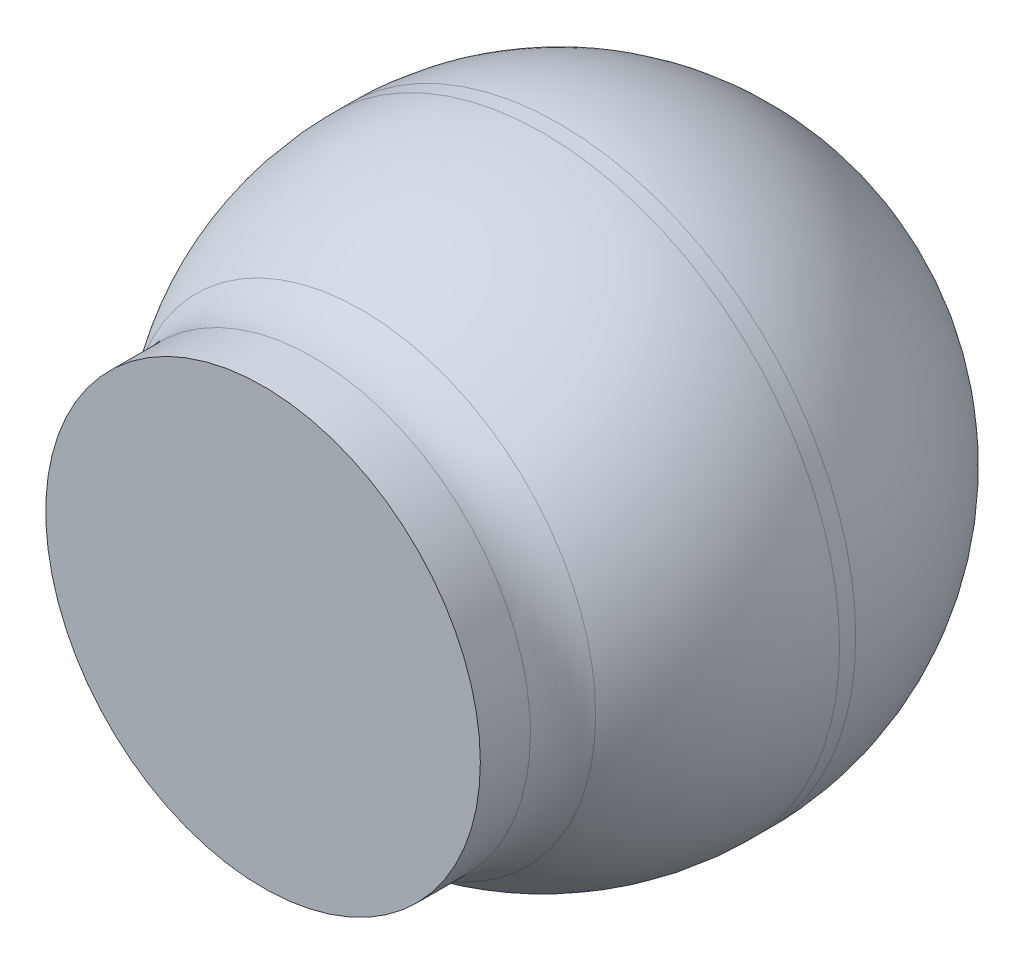
ISO-10303-21;
HEADER;
FILE_DESCRIPTION(('STEP AP214'),'2;1');
FILE_NAME('part.step','',(''),(''),'','','');
FILE_SCHEMA(('AUTOMOTIVE_DESIGN { 1 0 10303 214 1 1 1 1 }'));
ENDSEC;
DATA;
#1=APPLICATION_CONTEXT('core data for automotive mechanical design processes');
#2=APPLICATION_PROTOCOL_DEFINITION('international standard','automotive_design',2000,#1);
#3=PRODUCT_CONTEXT('',#1,'mechanical');
#4=PRODUCT('Part','Part','',(#3));
#5=PRODUCT_RELATED_PRODUCT_CATEGORY('part','',(#4));
#6=PRODUCT_DEFINITION_FORMATION('','',#4);
#7=PRODUCT_DEFINITION_CONTEXT('part definition',#1,'design');
#8=PRODUCT_DEFINITION('design','',#6,#7);
#9=PRODUCT_DEFINITION_SHAPE('','',#8);
#10=(LENGTH_UNIT() NAMED_UNIT(*) SI_UNIT(.MILLI.,.METRE.));
#11=(NAMED_UNIT(*) PLANE_ANGLE_UNIT() SI_UNIT($,.RADIAN.));
#12=(NAMED_UNIT(*) SI_UNIT($,.STERADIAN.) SOLID_ANGLE_UNIT());
#13=UNCERTAINTY_MEASURE_WITH_UNIT(LENGTH_MEASURE(1.E-05),#10,'distance_accuracy_value','');
#14=(GEOMETRIC_REPRESENTATION_CONTEXT(3) GLOBAL_UNCERTAINTY_ASSIGNED_CONTEXT((#13)) GLOBAL_UNIT_ASSIGNED_CONTEXT((#10,
#11,#12)) REPRESENTATION_CONTEXT('',''));
#15=CARTESIAN_POINT('',(0.,0.,0.));
#16=DIRECTION('',(0.,0.,1.));
#17=DIRECTION('',(1.,0.,0.));
#18=AXIS2_PLACEMENT_3D('',#15,#16,#17);
#19=CARTESIAN_POINT('',(1.977080077731,-11.67134929145,10.006534503384));
#20=DIRECTION('',(0.,0.,-1.));
#21=DIRECTION('',(-1.,0.,0.));
#22=AXIS2_PLACEMENT_3D('',#19,#20,#21);
#23=PLANE('',#22);
#24=CARTESIAN_POINT('',(1.977080077731,-11.67134929145,10.006534503384));
#25=DIRECTION('',(0.,0.,1.));
#26=DIRECTION('',(1.,0.,0.));
#27=AXIS2_PLACEMENT_3D('',#24,#25,#26);
#28=CIRCLE('',#27,0.275);
#29=CARTESIAN_POINT('',(2.252080077731,-11.67134929145,10.006534503384));
#30=VERTEX_POINT('',#29);
#31=EDGE_CURVE('E20',#30,#30,#28,.F.);
#32=ORIENTED_EDGE('',*,*,#31,.F.);
#33=EDGE_LOOP('',(#32));
#34=FACE_BOUND('',#33,.T.);
#35=ADVANCED_FACE('F17',(#34),#23,.F.);
#36=CARTESIAN_POINT('',(1.977080077731,-11.67134929145,9.906534503384));
#37=DIRECTION('',(0.,0.,1.));
#38=DIRECTION('',(1.,0.,0.));
#39=AXIS2_PLACEMENT_3D('',#36,#37,#38);
#40=CYLINDRICAL_SURFACE('',#39,0.275);
#41=CARTESIAN_POINT('',(1.977080077731,-11.67134929145,9.943180457728));
#42=DIRECTION('',(0.,0.,-1.));
#43=DIRECTION('',(0.996700902337582,0.081162252799247,0.));
#44=AXIS2_PLACEMENT_3D('',#41,#42,#43);
#45=CIRCLE('',#44,0.275);
#46=CARTESIAN_POINT('',(2.25117282587384,-11.6490296719302,9.943180457728));
#47=VERTEX_POINT('',#46);
#48=EDGE_CURVE('E66',#47,#47,#45,.F.);
#49=ORIENTED_EDGE('',*,*,#48,.T.);
#50=EDGE_LOOP('',(#49));
#51=FACE_BOUND('',#50,.T.);
#52=ORIENTED_EDGE('',*,*,#31,.T.);
#53=EDGE_LOOP('',(#52));
#54=FACE_BOUND('',#53,.T.);
#55=ADVANCED_FACE('F62',(#51,#54),#40,.T.);
#56=CARTESIAN_POINT('',(1.977080077731,-11.67134929145,9.943180457728));
#57=DIRECTION('',(0.,0.,-1.));
#58=DIRECTION('',(0.996700902337583,0.0811622527992448,0.));
#59=AXIS2_PLACEMENT_3D('',#56,#57,#58);
#60=TOROIDAL_SURFACE('',#59,0.375,0.1);
#61=ORIENTED_EDGE('',*,*,#48,.F.);
#62=EDGE_LOOP('',(#61));
#63=FACE_BOUND('',#62,.T.);
#64=CARTESIAN_POINT('',(1.977080077731,-11.67134929145,9.881744931236));
#65=DIRECTION('',(0.,0.,-1.));
#66=DIRECTION('',(-0.996700902338691,-0.0811622527856354,0.));
#67=AXIS2_PLACEMENT_3D('',#64,#65,#66);
#68=CIRCLE('',#67,0.29609704641234);
#69=CARTESIAN_POINT('',(1.681959884392,-11.69538119478,9.881744931236));
#70=VERTEX_POINT('',#69);
#71=EDGE_CURVE('E39',#70,#70,#68,.T.);
#72=ORIENTED_EDGE('',*,*,#71,.F.);
#73=EDGE_LOOP('',(#72));
#74=FACE_BOUND('',#73,.T.);
#75=ADVANCED_FACE('F57',(#63,#74),#60,.F.);
#76=CARTESIAN_POINT('',(1.603317239355,-11.70178513625,9.651976062157));
#77=CARTESIAN_POINT('',(1.603317239355,-11.70178513625,9.701461392103));
#78=CARTESIAN_POINT('',(1.611473782652,-11.70112094157,9.750947004335));
#79=CARTESIAN_POINT('',(1.627792914651,-11.69979205995,9.798626332798));
#80=CARTESIAN_POINT('',(1.651658609162,-11.69784865493,9.842699544317));
#81=CARTESIAN_POINT('',(1.681959884392,-11.69538119478,9.881744931236));
#82=(BOUNDED_CURVE() B_SPLINE_CURVE(5,(#76,#77,#78,#79,#80,#81),.UNSPECIFIED.,.F.,
.F.) B_SPLINE_CURVE_WITH_KNOTS((6,6),(0.,0.661568582165),
.UNSPECIFIED.) CURVE() GEOMETRIC_REPRESENTATION_ITEM() RATIONAL_B_SPLINE_CURVE((1.,1.,1.,1.,1.,1.)) REPRESENTATION_ITEM(''));
#83=CARTESIAN_POINT('',(1.977080077731,-11.67134929145,9.651976062157));
#84=DIRECTION('',(0.,0.,-1.));
#85=AXIS1_PLACEMENT('',#83,#84);
#86=SURFACE_OF_REVOLUTION('',#82,#85);
#87=CARTESIAN_POINT('',(1.977080077731,-11.67134929145,9.651976062157));
#88=DIRECTION('',(0.,0.,1.));
#89=DIRECTION('',(1.,0.,0.));
#90=AXIS2_PLACEMENT_3D('',#87,#88,#89);
#91=CIRCLE('',#90,0.375);
#92=CARTESIAN_POINT('',(2.352080077731,-11.67134929145,9.651976062157));
#93=VERTEX_POINT('',#92);
#94=EDGE_CURVE('E36',#93,#93,#91,.F.);
#95=ORIENTED_EDGE('',*,*,#94,.F.);
#96=EDGE_LOOP('',(#95));
#97=FACE_BOUND('',#96,.T.);
#98=ORIENTED_EDGE('',*,*,#71,.T.);
#99=EDGE_LOOP('',(#98));
#100=FACE_BOUND('',#99,.T.);
#101=ADVANCED_FACE('F53',(#97,#100),#86,.F.);
#102=CARTESIAN_POINT('',(1.977080077731,-11.67134929145,9.256534503384));
#103=DIRECTION('',(0.,0.,1.));
#104=DIRECTION('',(1.,0.,0.));
#105=AXIS2_PLACEMENT_3D('',#102,#103,#104);
#106=CYLINDRICAL_SURFACE('',#105,0.375);
#107=CARTESIAN_POINT('',(1.977080077731,-11.67134929145,9.631534503384));
#108=DIRECTION('',(0.,0.,-1.));
#109=DIRECTION('',(0.0811622527992357,-0.996700902337583,0.));
#110=AXIS2_PLACEMENT_3D('',#107,#108,#109);
#111=CIRCLE('',#110,0.375);
#112=CARTESIAN_POINT('',(2.00751592253071,-12.0451121298266,9.631534503384));
#113=VERTEX_POINT('',#112);
#114=CARTESIAN_POINT('',(1.94664423293129,-11.2975864530734,9.631534503384));
#115=VERTEX_POINT('',#114);
#116=EDGE_CURVE('E11',#113,#115,#111,.T.);
#117=ORIENTED_EDGE('',*,*,#116,.F.);
#118=CARTESIAN_POINT('',(1.977080077731,-11.67134929145,9.631534503384));
#119=DIRECTION('',(3.33436315446763E-12,2.72100352061447E-13,1.));
#120=DIRECTION('',(0.0811622527992365,-0.996700902337583,0.));
#121=AXIS2_PLACEMENT_3D('',#118,#119,#120);
#122=CIRCLE('',#121,0.375);
#123=EDGE_CURVE('E25',#115,#113,#122,.F.);
#124=ORIENTED_EDGE('',*,*,#123,.F.);
#125=EDGE_LOOP('',(#117,#124));
#126=FACE_BOUND('',#125,.T.);
#127=ORIENTED_EDGE('',*,*,#94,.T.);
#128=EDGE_LOOP('',(#127));
#129=FACE_BOUND('',#128,.T.);
#130=ADVANCED_FACE('F34',(#126,#129),#106,.T.);
#131=CARTESIAN_POINT('',(1.977080077731,-11.67134929145,9.631534503384));
#132=DIRECTION('',(0.0811622527992361,-0.996700902337583,0.));
#133=DIRECTION('',(-0.996700902337583,-0.0811622527992361,0.));
#134=AXIS2_PLACEMENT_3D('',#131,#132,#133);
#135=SPHERICAL_SURFACE('',#134,0.375);
#136=ORIENTED_EDGE('',*,*,#123,.T.);
#137=ORIENTED_EDGE('',*,*,#116,.T.);
#138=EDGE_LOOP('',(#136,#137));
#139=FACE_BOUND('',#138,.T.);
#140=ADVANCED_FACE('F32',(#139),#135,.T.);
#141=CLOSED_SHELL('',(#35,#55,#75,#101,#130,#140));
#142=MANIFOLD_SOLID_BREP('B1',#141);
#143=ADVANCED_BREP_SHAPE_REPRESENTATION('',(#18,#142),#14);
#144=SHAPE_DEFINITION_REPRESENTATION(#9,#143);
ENDSEC;
END-ISO-10303-21;
